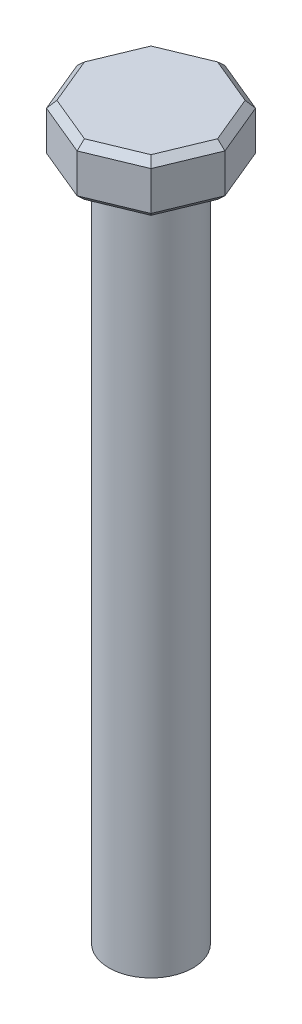
ISO-10303-21;
HEADER;
FILE_DESCRIPTION(('STEP AP214'),'2;1');
FILE_NAME('part.step','',(''),(''),'','','');
FILE_SCHEMA(('AUTOMOTIVE_DESIGN { 1 0 10303 214 1 1 1 1 }'));
ENDSEC;
DATA;
#1=APPLICATION_CONTEXT('core data for automotive mechanical design processes');
#2=APPLICATION_PROTOCOL_DEFINITION('international standard','automotive_design',2000,#1);
#3=PRODUCT_CONTEXT('',#1,'mechanical');
#4=PRODUCT('Part','Part','',(#3));
#5=PRODUCT_RELATED_PRODUCT_CATEGORY('part','',(#4));
#6=PRODUCT_DEFINITION_FORMATION('','',#4);
#7=PRODUCT_DEFINITION_CONTEXT('part definition',#1,'design');
#8=PRODUCT_DEFINITION('design','',#6,#7);
#9=PRODUCT_DEFINITION_SHAPE('','',#8);
#10=(LENGTH_UNIT() NAMED_UNIT(*) SI_UNIT(.MILLI.,.METRE.));
#11=(NAMED_UNIT(*) PLANE_ANGLE_UNIT() SI_UNIT($,.RADIAN.));
#12=(NAMED_UNIT(*) SI_UNIT($,.STERADIAN.) SOLID_ANGLE_UNIT());
#13=UNCERTAINTY_MEASURE_WITH_UNIT(LENGTH_MEASURE(1.E-05),#10,'distance_accuracy_value','');
#14=(GEOMETRIC_REPRESENTATION_CONTEXT(3) GLOBAL_UNCERTAINTY_ASSIGNED_CONTEXT((#13)) GLOBAL_UNIT_ASSIGNED_CONTEXT((#10,
#11,#12)) REPRESENTATION_CONTEXT('',''));
#15=CARTESIAN_POINT('',(0.,0.,0.));
#16=DIRECTION('',(0.,0.,1.));
#17=DIRECTION('',(1.,0.,0.));
#18=AXIS2_PLACEMENT_3D('',#15,#16,#17);
#19=CARTESIAN_POINT('',(0.,64.5,0.));
#20=DIRECTION('',(0.,-1.,0.));
#21=DIRECTION('',(0.,0.,-1.));
#22=AXIS2_PLACEMENT_3D('',#19,#20,#21);
#23=CYLINDRICAL_SURFACE('',#22,4.);
#24=CARTESIAN_POINT('',(0.,64.5,0.));
#25=DIRECTION('',(0.,1.,0.));
#26=DIRECTION('',(0.,0.,1.));
#27=AXIS2_PLACEMENT_3D('',#24,#25,#26);
#28=CIRCLE('',#27,4.);
#29=CARTESIAN_POINT('',(0.,64.5,4.));
#30=VERTEX_POINT('',#29);
#31=EDGE_CURVE('E172',#30,#30,#28,.T.);
#32=ORIENTED_EDGE('',*,*,#31,.F.);
#33=EDGE_LOOP('',(#32));
#34=FACE_BOUND('',#33,.T.);
#35=CARTESIAN_POINT('',(0.,0.,0.));
#36=DIRECTION('',(0.,1.,0.));
#37=DIRECTION('',(0.,0.,1.));
#38=AXIS2_PLACEMENT_3D('',#35,#36,#37);
#39=CIRCLE('',#38,4.);
#40=CARTESIAN_POINT('',(0.,0.,4.));
#41=VERTEX_POINT('',#40);
#42=EDGE_CURVE('E313',#41,#41,#39,.T.);
#43=ORIENTED_EDGE('',*,*,#42,.T.);
#44=EDGE_LOOP('',(#43));
#45=FACE_BOUND('',#44,.T.);
#46=ADVANCED_FACE('F37',(#34,#45),#23,.T.);
#47=CARTESIAN_POINT('',(0.,0.,0.));
#48=DIRECTION('',(0.,1.,0.));
#49=DIRECTION('',(0.,0.,1.));
#50=AXIS2_PLACEMENT_3D('',#47,#48,#49);
#51=PLANE('',#50);
#52=ORIENTED_EDGE('',*,*,#42,.F.);
#53=EDGE_LOOP('',(#52));
#54=FACE_BOUND('',#53,.T.);
#55=ADVANCED_FACE('F376',(#54),#51,.F.);
#56=CARTESIAN_POINT('',(4.97488462074616,69.5,4.97488462074617));
#57=DIRECTION('',(-0.923879532511287,0.,-0.38268343236509));
#58=DIRECTION('',(-0.38268343236509,0.,0.923879532511287));
#59=AXIS2_PLACEMENT_3D('',#56,#57,#58);
#60=PLANE('',#59);
#61=DIRECTION('',(0.,-1.,0.));
#62=VECTOR('',#61,1.);
#63=CARTESIAN_POINT('',(7.03554930190056,69.5,0.));
#64=LINE('',#63,#62);
#65=CARTESIAN_POINT('',(7.03554930190056,68.85,0.));
#66=VERTEX_POINT('',#65);
#67=CARTESIAN_POINT('',(7.03554930190056,65.15,0.));
#68=VERTEX_POINT('',#67);
#69=EDGE_CURVE('E310',#66,#68,#64,.T.);
#70=ORIENTED_EDGE('',*,*,#69,.F.);
#71=DIRECTION('',(-0.38268343236509,0.,0.923879532511287));
#72=VECTOR('',#71,1.);
#73=CARTESIAN_POINT('',(4.97488462074616,68.85,4.97488462074617));
#74=LINE('',#73,#72);
#75=CARTESIAN_POINT('',(4.97488462074616,68.85,4.97488462074617));
#76=VERTEX_POINT('',#75);
#77=EDGE_CURVE('E213',#66,#76,#74,.T.);
#78=ORIENTED_EDGE('',*,*,#77,.T.);
#79=DIRECTION('',(0.,-1.,0.));
#80=VECTOR('',#79,1.);
#81=CARTESIAN_POINT('',(4.97488462074616,69.5,4.97488462074617));
#82=LINE('',#81,#80);
#83=CARTESIAN_POINT('',(4.97488462074616,65.15,4.97488462074617));
#84=VERTEX_POINT('',#83);
#85=EDGE_CURVE('E245',#76,#84,#82,.T.);
#86=ORIENTED_EDGE('',*,*,#85,.T.);
#87=DIRECTION('',(0.38268343236509,0.,-0.923879532511287));
#88=VECTOR('',#87,1.);
#89=CARTESIAN_POINT('',(4.97488462074616,65.15,4.97488462074617));
#90=LINE('',#89,#88);
#91=EDGE_CURVE('E211',#84,#68,#90,.T.);
#92=ORIENTED_EDGE('',*,*,#91,.T.);
#93=EDGE_LOOP('',(#70,#78,#86,#92));
#94=FACE_BOUND('',#93,.T.);
#95=ADVANCED_FACE('F350',(#94),#60,.F.);
#96=CARTESIAN_POINT('',(7.03554930190056,69.5,0.));
#97=DIRECTION('',(-0.923879532511287,0.,0.382683432365089));
#98=DIRECTION('',(0.382683432365089,0.,0.923879532511287));
#99=AXIS2_PLACEMENT_3D('',#96,#97,#98);
#100=PLANE('',#99);
#101=DIRECTION('',(0.,-1.,0.));
#102=VECTOR('',#101,1.);
#103=CARTESIAN_POINT('',(4.97488462074617,69.5,-4.97488462074617));
#104=LINE('',#103,#102);
#105=CARTESIAN_POINT('',(4.97488462074617,68.85,-4.97488462074617));
#106=VERTEX_POINT('',#105);
#107=CARTESIAN_POINT('',(4.97488462074617,65.15,-4.97488462074617));
#108=VERTEX_POINT('',#107);
#109=EDGE_CURVE('E302',#106,#108,#104,.T.);
#110=ORIENTED_EDGE('',*,*,#109,.F.);
#111=DIRECTION('',(0.382683432365089,0.,0.923879532511287));
#112=VECTOR('',#111,1.);
#113=CARTESIAN_POINT('',(7.03554930190056,68.85,0.));
#114=LINE('',#113,#112);
#115=EDGE_CURVE('E209',#106,#66,#114,.T.);
#116=ORIENTED_EDGE('',*,*,#115,.T.);
#117=ORIENTED_EDGE('',*,*,#69,.T.);
#118=DIRECTION('',(-0.382683432365089,0.,-0.923879532511287));
#119=VECTOR('',#118,1.);
#120=CARTESIAN_POINT('',(7.03554930190056,65.15,0.));
#121=LINE('',#120,#119);
#122=EDGE_CURVE('E207',#68,#108,#121,.T.);
#123=ORIENTED_EDGE('',*,*,#122,.T.);
#124=EDGE_LOOP('',(#110,#116,#117,#123));
#125=FACE_BOUND('',#124,.T.);
#126=ADVANCED_FACE('F568',(#125),#100,.F.);
#127=CARTESIAN_POINT('',(4.97488462074617,69.5,-4.97488462074617));
#128=DIRECTION('',(-0.382683432365084,0.,0.923879532511289));
#129=DIRECTION('',(0.923879532511289,0.,0.382683432365084));
#130=AXIS2_PLACEMENT_3D('',#127,#128,#129);
#131=PLANE('',#130);
#132=DIRECTION('',(0.,-1.,0.));
#133=VECTOR('',#132,1.);
#134=CARTESIAN_POINT('',(0.,69.5,-7.03554930190056));
#135=LINE('',#134,#133);
#136=CARTESIAN_POINT('',(0.,68.85,-7.03554930190056));
#137=VERTEX_POINT('',#136);
#138=CARTESIAN_POINT('',(0.,65.15,-7.03554930190056));
#139=VERTEX_POINT('',#138);
#140=EDGE_CURVE('E294',#137,#139,#135,.T.);
#141=ORIENTED_EDGE('',*,*,#140,.F.);
#142=DIRECTION('',(0.923879532511289,0.,0.382683432365084));
#143=VECTOR('',#142,1.);
#144=CARTESIAN_POINT('',(4.97488462074617,68.85,-4.97488462074617));
#145=LINE('',#144,#143);
#146=EDGE_CURVE('E205',#137,#106,#145,.T.);
#147=ORIENTED_EDGE('',*,*,#146,.T.);
#148=ORIENTED_EDGE('',*,*,#109,.T.);
#149=DIRECTION('',(-0.923879532511289,0.,-0.382683432365084));
#150=VECTOR('',#149,1.);
#151=CARTESIAN_POINT('',(4.97488462074617,65.15,-4.97488462074617));
#152=LINE('',#151,#150);
#153=EDGE_CURVE('E203',#108,#139,#152,.T.);
#154=ORIENTED_EDGE('',*,*,#153,.T.);
#155=EDGE_LOOP('',(#141,#147,#148,#154));
#156=FACE_BOUND('',#155,.T.);
#157=ADVANCED_FACE('F560',(#156),#131,.F.);
#158=CARTESIAN_POINT('',(0.,69.5,-7.03554930190056));
#159=DIRECTION('',(0.382683432365095,0.,0.923879532511285));
#160=DIRECTION('',(0.923879532511285,0.,-0.382683432365095));
#161=AXIS2_PLACEMENT_3D('',#158,#159,#160);
#162=PLANE('',#161);
#163=DIRECTION('',(0.,-1.,0.));
#164=VECTOR('',#163,1.);
#165=CARTESIAN_POINT('',(-4.97488462074616,69.5,-4.97488462074617));
#166=LINE('',#165,#164);
#167=CARTESIAN_POINT('',(-4.97488462074616,68.85,-4.97488462074617));
#168=VERTEX_POINT('',#167);
#169=CARTESIAN_POINT('',(-4.97488462074616,65.15,-4.97488462074617));
#170=VERTEX_POINT('',#169);
#171=EDGE_CURVE('E291',#168,#170,#166,.T.);
#172=ORIENTED_EDGE('',*,*,#171,.F.);
#173=DIRECTION('',(0.923879532511285,0.,-0.382683432365095));
#174=VECTOR('',#173,1.);
#175=CARTESIAN_POINT('',(0.,68.85,-7.03554930190056));
#176=LINE('',#175,#174);
#177=EDGE_CURVE('E201',#168,#137,#176,.T.);
#178=ORIENTED_EDGE('',*,*,#177,.T.);
#179=ORIENTED_EDGE('',*,*,#140,.T.);
#180=DIRECTION('',(-0.923879532511285,0.,0.382683432365095));
#181=VECTOR('',#180,1.);
#182=CARTESIAN_POINT('',(0.,65.15,-7.03554930190056));
#183=LINE('',#182,#181);
#184=EDGE_CURVE('E199',#139,#170,#183,.T.);
#185=ORIENTED_EDGE('',*,*,#184,.T.);
#186=EDGE_LOOP('',(#172,#178,#179,#185));
#187=FACE_BOUND('',#186,.T.);
#188=ADVANCED_FACE('F290',(#187),#162,.F.);
#189=CARTESIAN_POINT('',(-4.97488462074616,69.5,-4.97488462074617));
#190=DIRECTION('',(0.923879532511287,0.,0.38268343236509));
#191=DIRECTION('',(0.38268343236509,0.,-0.923879532511287));
#192=AXIS2_PLACEMENT_3D('',#189,#190,#191);
#193=PLANE('',#192);
#194=DIRECTION('',(0.,-1.,0.));
#195=VECTOR('',#194,1.);
#196=CARTESIAN_POINT('',(-7.03554930190056,69.5,0.));
#197=LINE('',#196,#195);
#198=CARTESIAN_POINT('',(-7.03554930190056,68.85,0.));
#199=VERTEX_POINT('',#198);
#200=CARTESIAN_POINT('',(-7.03554930190056,65.15,0.));
#201=VERTEX_POINT('',#200);
#202=EDGE_CURVE('E300',#199,#201,#197,.T.);
#203=ORIENTED_EDGE('',*,*,#202,.F.);
#204=DIRECTION('',(0.38268343236509,0.,-0.923879532511287));
#205=VECTOR('',#204,1.);
#206=CARTESIAN_POINT('',(-4.97488462074616,68.85,-4.97488462074617));
#207=LINE('',#206,#205);
#208=EDGE_CURVE('E197',#199,#168,#207,.T.);
#209=ORIENTED_EDGE('',*,*,#208,.T.);
#210=ORIENTED_EDGE('',*,*,#171,.T.);
#211=DIRECTION('',(-0.38268343236509,0.,0.923879532511287));
#212=VECTOR('',#211,1.);
#213=CARTESIAN_POINT('',(-4.97488462074616,65.15,-4.97488462074617));
#214=LINE('',#213,#212);
#215=EDGE_CURVE('E194',#170,#201,#214,.T.);
#216=ORIENTED_EDGE('',*,*,#215,.T.);
#217=EDGE_LOOP('',(#203,#209,#210,#216));
#218=FACE_BOUND('',#217,.T.);
#219=ADVANCED_FACE('F297',(#218),#193,.F.);
#220=CARTESIAN_POINT('',(-7.03554930190056,69.5,0.));
#221=DIRECTION('',(0.923879532511287,0.,-0.382683432365089));
#222=DIRECTION('',(-0.382683432365089,0.,-0.923879532511287));
#223=AXIS2_PLACEMENT_3D('',#220,#221,#222);
#224=PLANE('',#223);
#225=DIRECTION('',(0.,-1.,0.));
#226=VECTOR('',#225,1.);
#227=CARTESIAN_POINT('',(-4.97488462074617,69.5,4.97488462074616));
#228=LINE('',#227,#226);
#229=CARTESIAN_POINT('',(-4.97488462074617,68.85,4.97488462074616));
#230=VERTEX_POINT('',#229);
#231=CARTESIAN_POINT('',(-4.97488462074617,65.15,4.97488462074616));
#232=VERTEX_POINT('',#231);
#233=EDGE_CURVE('E304',#230,#232,#228,.T.);
#234=ORIENTED_EDGE('',*,*,#233,.F.);
#235=DIRECTION('',(-0.382683432365089,0.,-0.923879532511287));
#236=VECTOR('',#235,1.);
#237=CARTESIAN_POINT('',(-7.03554930190056,68.85,0.));
#238=LINE('',#237,#236);
#239=EDGE_CURVE('E192',#230,#199,#238,.T.);
#240=ORIENTED_EDGE('',*,*,#239,.T.);
#241=ORIENTED_EDGE('',*,*,#202,.T.);
#242=DIRECTION('',(0.382683432365089,0.,0.923879532511287));
#243=VECTOR('',#242,1.);
#244=CARTESIAN_POINT('',(-7.03554930190056,65.15,0.));
#245=LINE('',#244,#243);
#246=EDGE_CURVE('E190',#201,#232,#245,.T.);
#247=ORIENTED_EDGE('',*,*,#246,.T.);
#248=EDGE_LOOP('',(#234,#240,#241,#247));
#249=FACE_BOUND('',#248,.T.);
#250=ADVANCED_FACE('F537',(#249),#224,.F.);
#251=CARTESIAN_POINT('',(-4.97488462074617,69.5,4.97488462074616));
#252=DIRECTION('',(0.38268343236509,0.,-0.923879532511287));
#253=DIRECTION('',(-0.923879532511287,0.,-0.38268343236509));
#254=AXIS2_PLACEMENT_3D('',#251,#252,#253);
#255=PLANE('',#254);
#256=DIRECTION('',(0.,-1.,0.));
#257=VECTOR('',#256,1.);
#258=CARTESIAN_POINT('',(0.,69.5,7.03554930190056));
#259=LINE('',#258,#257);
#260=CARTESIAN_POINT('',(0.,68.85,7.03554930190056));
#261=VERTEX_POINT('',#260);
#262=CARTESIAN_POINT('',(0.,65.15,7.03554930190056));
#263=VERTEX_POINT('',#262);
#264=EDGE_CURVE('E342',#261,#263,#259,.T.);
#265=ORIENTED_EDGE('',*,*,#264,.F.);
#266=DIRECTION('',(-0.923879532511287,0.,-0.38268343236509));
#267=VECTOR('',#266,1.);
#268=CARTESIAN_POINT('',(-4.97488462074617,68.85,4.97488462074616));
#269=LINE('',#268,#267);
#270=EDGE_CURVE('E188',#261,#230,#269,.T.);
#271=ORIENTED_EDGE('',*,*,#270,.T.);
#272=ORIENTED_EDGE('',*,*,#233,.T.);
#273=DIRECTION('',(0.923879532511287,0.,0.38268343236509));
#274=VECTOR('',#273,1.);
#275=CARTESIAN_POINT('',(-4.97488462074617,65.15,4.97488462074616));
#276=LINE('',#275,#274);
#277=EDGE_CURVE('E186',#232,#263,#276,.T.);
#278=ORIENTED_EDGE('',*,*,#277,.T.);
#279=EDGE_LOOP('',(#265,#271,#272,#278));
#280=FACE_BOUND('',#279,.T.);
#281=ADVANCED_FACE('F344',(#280),#255,.F.);
#282=CARTESIAN_POINT('',(0.,69.5,7.03554930190056));
#283=DIRECTION('',(-0.382683432365089,0.,-0.923879532511287));
#284=DIRECTION('',(-0.923879532511287,0.,0.382683432365089));
#285=AXIS2_PLACEMENT_3D('',#282,#283,#284);
#286=PLANE('',#285);
#287=ORIENTED_EDGE('',*,*,#85,.F.);
#288=DIRECTION('',(-0.923879532511287,0.,0.382683432365089));
#289=VECTOR('',#288,1.);
#290=CARTESIAN_POINT('',(0.,68.85,7.03554930190056));
#291=LINE('',#290,#289);
#292=EDGE_CURVE('E159',#76,#261,#291,.T.);
#293=ORIENTED_EDGE('',*,*,#292,.T.);
#294=ORIENTED_EDGE('',*,*,#264,.T.);
#295=DIRECTION('',(0.923879532511287,0.,-0.382683432365089));
#296=VECTOR('',#295,1.);
#297=CARTESIAN_POINT('',(0.,65.15,7.03554930190056));
#298=LINE('',#297,#296);
#299=EDGE_CURVE('E178',#263,#84,#298,.T.);
#300=ORIENTED_EDGE('',*,*,#299,.T.);
#301=EDGE_LOOP('',(#287,#293,#294,#300));
#302=FACE_BOUND('',#301,.T.);
#303=ADVANCED_FACE('F341',(#302),#286,.F.);
#304=CARTESIAN_POINT('',(0.,69.5,0.));
#305=DIRECTION('',(0.,1.,0.));
#306=DIRECTION('',(0.,0.,1.));
#307=AXIS2_PLACEMENT_3D('',#304,#305,#306);
#308=PLANE('',#307);
#309=DIRECTION('',(0.923879532511287,0.,0.38268343236509));
#310=VECTOR('',#309,1.);
#311=CARTESIAN_POINT('',(0.248744231037304,69.5,6.43502760576823));
#312=LINE('',#311,#310);
#313=CARTESIAN_POINT('',(-4.47739615867156,69.5,4.47739615867155));
#314=VERTEX_POINT('',#313);
#315=CARTESIAN_POINT('',(0.,69.5,6.33199437171051));
#316=VERTEX_POINT('',#315);
#317=EDGE_CURVE('E176',#314,#316,#312,.T.);
#318=ORIENTED_EDGE('',*,*,#317,.T.);
#319=DIRECTION('',(0.923879532511287,0.,-0.382683432365089));
#320=VECTOR('',#319,1.);
#321=CARTESIAN_POINT('',(4.72614038970886,69.5,4.37436292461384));
#322=LINE('',#321,#320);
#323=CARTESIAN_POINT('',(4.47739615867155,69.5,4.47739615867156));
#324=VERTEX_POINT('',#323);
#325=EDGE_CURVE('E157',#316,#324,#322,.T.);
#326=ORIENTED_EDGE('',*,*,#325,.T.);
#327=DIRECTION('',(0.38268343236509,0.,-0.923879532511287));
#328=VECTOR('',#327,1.);
#329=CARTESIAN_POINT('',(6.43502760576823,69.5,-0.248744231037306));
#330=LINE('',#329,#328);
#331=CARTESIAN_POINT('',(6.33199437171051,69.5,0.));
#332=VERTEX_POINT('',#331);
#333=EDGE_CURVE('E165',#324,#332,#330,.T.);
#334=ORIENTED_EDGE('',*,*,#333,.T.);
#335=DIRECTION('',(-0.382683432365089,0.,-0.923879532511287));
#336=VECTOR('',#335,1.);
#337=CARTESIAN_POINT('',(4.37436292461384,69.5,-4.72614038970886));
#338=LINE('',#337,#336);
#339=CARTESIAN_POINT('',(4.47739615867156,69.5,-4.47739615867155));
#340=VERTEX_POINT('',#339);
#341=EDGE_CURVE('E171',#332,#340,#338,.T.);
#342=ORIENTED_EDGE('',*,*,#341,.T.);
#343=DIRECTION('',(-0.923879532511289,0.,-0.382683432365084));
#344=VECTOR('',#343,1.);
#345=CARTESIAN_POINT('',(-0.248744231037386,69.5,-6.43502760576823));
#346=LINE('',#345,#344);
#347=CARTESIAN_POINT('',(0.,69.5,-6.33199437171051));
#348=VERTEX_POINT('',#347);
#349=EDGE_CURVE('E319',#340,#348,#346,.T.);
#350=ORIENTED_EDGE('',*,*,#349,.T.);
#351=DIRECTION('',(-0.923879532511285,0.,0.382683432365095));
#352=VECTOR('',#351,1.);
#353=CARTESIAN_POINT('',(-4.72614038970885,69.5,-4.37436292461384));
#354=LINE('',#353,#352);
#355=CARTESIAN_POINT('',(-4.47739615867155,69.5,-4.47739615867156));
#356=VERTEX_POINT('',#355);
#357=EDGE_CURVE('E321',#348,#356,#354,.T.);
#358=ORIENTED_EDGE('',*,*,#357,.T.);
#359=DIRECTION('',(-0.38268343236509,0.,0.923879532511287));
#360=VECTOR('',#359,1.);
#361=CARTESIAN_POINT('',(-6.43502760576823,69.5,0.248744231037305));
#362=LINE('',#361,#360);
#363=CARTESIAN_POINT('',(-6.33199437171051,69.5,0.));
#364=VERTEX_POINT('',#363);
#365=EDGE_CURVE('E323',#356,#364,#362,.T.);
#366=ORIENTED_EDGE('',*,*,#365,.T.);
#367=DIRECTION('',(0.38268343236509,0.,0.923879532511287));
#368=VECTOR('',#367,1.);
#369=CARTESIAN_POINT('',(-4.37436292461384,69.5,4.72614038970886));
#370=LINE('',#369,#368);
#371=EDGE_CURVE('E181',#364,#314,#370,.T.);
#372=ORIENTED_EDGE('',*,*,#371,.T.);
#373=EDGE_LOOP('',(#318,#326,#334,#342,#350,#358,#366,#372));
#374=FACE_BOUND('',#373,.T.);
#375=ADVANCED_FACE('F174',(#374),#308,.T.);
#376=CARTESIAN_POINT('',(0.,64.5,0.));
#377=DIRECTION('',(0.,1.,0.));
#378=DIRECTION('',(0.,0.,1.));
#379=AXIS2_PLACEMENT_3D('',#376,#377,#378);
#380=PLANE('',#379);
#381=DIRECTION('',(-0.38268343236509,0.,-0.923879532511287));
#382=VECTOR('',#381,1.);
#383=CARTESIAN_POINT('',(-5.40469526519102,64.5,2.23869807933577));
#384=LINE('',#383,#382);
#385=CARTESIAN_POINT('',(-4.47739615867154,64.5,4.47739615867154));
#386=VERTEX_POINT('',#385);
#387=CARTESIAN_POINT('',(-6.33199437171049,64.5,0.));
#388=VERTEX_POINT('',#387);
#389=EDGE_CURVE('E215',#386,#388,#384,.T.);
#390=ORIENTED_EDGE('',*,*,#389,.T.);
#391=DIRECTION('',(0.38268343236509,0.,-0.923879532511287));
#392=VECTOR('',#391,1.);
#393=CARTESIAN_POINT('',(-5.40469526519102,64.5,-2.23869807933577));
#394=LINE('',#393,#392);
#395=CARTESIAN_POINT('',(-4.47739615867154,64.5,-4.47739615867155));
#396=VERTEX_POINT('',#395);
#397=EDGE_CURVE('E11',#388,#396,#394,.T.);
#398=ORIENTED_EDGE('',*,*,#397,.T.);
#399=DIRECTION('',(0.923879532511285,0.,-0.382683432365095));
#400=VECTOR('',#399,1.);
#401=CARTESIAN_POINT('',(-2.23869807933581,64.5,-5.40469526519102));
#402=LINE('',#401,#400);
#403=CARTESIAN_POINT('',(0.,64.5,-6.33199437171049));
#404=VERTEX_POINT('',#403);
#405=EDGE_CURVE('E46',#396,#404,#402,.T.);
#406=ORIENTED_EDGE('',*,*,#405,.T.);
#407=DIRECTION('',(0.923879532511289,0.,0.382683432365084));
#408=VECTOR('',#407,1.);
#409=CARTESIAN_POINT('',(2.23869807933573,64.5,-5.40469526519102));
#410=LINE('',#409,#408);
#411=CARTESIAN_POINT('',(4.47739615867154,64.5,-4.47739615867154));
#412=VERTEX_POINT('',#411);
#413=EDGE_CURVE('E225',#404,#412,#410,.T.);
#414=ORIENTED_EDGE('',*,*,#413,.T.);
#415=DIRECTION('',(0.382683432365089,0.,0.923879532511287));
#416=VECTOR('',#415,1.);
#417=CARTESIAN_POINT('',(5.40469526519102,64.5,-2.23869807933577));
#418=LINE('',#417,#416);
#419=CARTESIAN_POINT('',(6.33199437171049,64.5,0.));
#420=VERTEX_POINT('',#419);
#421=EDGE_CURVE('E223',#412,#420,#418,.T.);
#422=ORIENTED_EDGE('',*,*,#421,.T.);
#423=DIRECTION('',(-0.38268343236509,0.,0.923879532511287));
#424=VECTOR('',#423,1.);
#425=CARTESIAN_POINT('',(5.40469526519102,64.5,2.23869807933577));
#426=LINE('',#425,#424);
#427=CARTESIAN_POINT('',(4.47739615867154,64.5,4.47739615867154));
#428=VERTEX_POINT('',#427);
#429=EDGE_CURVE('E221',#420,#428,#426,.T.);
#430=ORIENTED_EDGE('',*,*,#429,.T.);
#431=DIRECTION('',(-0.923879532511287,0.,0.382683432365089));
#432=VECTOR('',#431,1.);
#433=CARTESIAN_POINT('',(2.23869807933577,64.5,5.40469526519102));
#434=LINE('',#433,#432);
#435=CARTESIAN_POINT('',(0.,64.5,6.33199437171049));
#436=VERTEX_POINT('',#435);
#437=EDGE_CURVE('E219',#428,#436,#434,.T.);
#438=ORIENTED_EDGE('',*,*,#437,.T.);
#439=DIRECTION('',(-0.923879532511287,0.,-0.38268343236509));
#440=VECTOR('',#439,1.);
#441=CARTESIAN_POINT('',(-2.23869807933577,64.5,5.40469526519102));
#442=LINE('',#441,#440);
#443=EDGE_CURVE('E217',#436,#386,#442,.T.);
#444=ORIENTED_EDGE('',*,*,#443,.T.);
#445=EDGE_LOOP('',(#390,#398,#406,#414,#422,#430,#438,#444));
#446=FACE_BOUND('',#445,.T.);
#447=ORIENTED_EDGE('',*,*,#31,.T.);
#448=EDGE_LOOP('',(#447));
#449=FACE_BOUND('',#448,.T.);
#450=ADVANCED_FACE('F276',(#446,#449),#380,.F.);
#451=CARTESIAN_POINT('',(-2.23869807933581,69.5,-5.40469526519104));
#452=DIRECTION('',(-0.270598050073103,0.707106781186545,-0.653281482438189));
#453=DIRECTION('',(0.923879532511285,0.,-0.382683432365095));
#454=AXIS2_PLACEMENT_3D('',#451,#452,#453);
#455=PLANE('',#454);
#456=DIRECTION('',(0.,0.678598344545849,0.734509555267753));
#457=VECTOR('',#456,1.);
#458=CARTESIAN_POINT('',(0.,69.9622001553218,-5.83171252861632));
#459=LINE('',#458,#457);
#460=EDGE_CURVE('E239',#137,#348,#459,.T.);
#461=ORIENTED_EDGE('',*,*,#460,.F.);
#462=ORIENTED_EDGE('',*,*,#177,.F.);
#463=DIRECTION('',(0.519376687376145,0.67859834454585,0.519376687376142));
#464=VECTOR('',#463,1.);
#465=CARTESIAN_POINT('',(-4.12364347491516,69.9622001553217,-4.12364347491517));
#466=LINE('',#465,#464);
#467=EDGE_CURVE('E242',#356,#168,#466,.F.);
#468=ORIENTED_EDGE('',*,*,#467,.F.);
#469=ORIENTED_EDGE('',*,*,#357,.F.);
#470=EDGE_LOOP('',(#461,#462,#468,#469));
#471=FACE_BOUND('',#470,.T.);
#472=ADVANCED_FACE('F363',(#471),#455,.T.);
#473=CARTESIAN_POINT('',(-5.40469526519103,69.5,-2.23869807933578));
#474=DIRECTION('',(-0.653281482438191,0.707106781186545,-0.270598050073099));
#475=DIRECTION('',(0.38268343236509,0.,-0.923879532511287));
#476=AXIS2_PLACEMENT_3D('',#473,#474,#475);
#477=PLANE('',#476);
#478=ORIENTED_EDGE('',*,*,#467,.T.);
#479=ORIENTED_EDGE('',*,*,#208,.F.);
#480=DIRECTION('',(0.734509555267753,0.67859834454585,0.));
#481=VECTOR('',#480,1.);
#482=CARTESIAN_POINT('',(-5.83171252861633,69.9622001553217,0.));
#483=LINE('',#482,#481);
#484=EDGE_CURVE('E236',#364,#199,#483,.F.);
#485=ORIENTED_EDGE('',*,*,#484,.F.);
#486=ORIENTED_EDGE('',*,*,#365,.F.);
#487=EDGE_LOOP('',(#478,#479,#485,#486));
#488=FACE_BOUND('',#487,.T.);
#489=ADVANCED_FACE('F366',(#488),#477,.T.);
#490=CARTESIAN_POINT('',(2.23869807933574,69.5,-5.40469526519103));
#491=DIRECTION('',(0.270598050073096,0.707106781186545,-0.653281482438192));
#492=DIRECTION('',(0.923879532511289,0.,0.382683432365084));
#493=AXIS2_PLACEMENT_3D('',#490,#491,#492);
#494=PLANE('',#493);
#495=ORIENTED_EDGE('',*,*,#460,.T.);
#496=ORIENTED_EDGE('',*,*,#349,.F.);
#497=DIRECTION('',(-0.519376687376142,0.678598344545849,0.519376687376146));
#498=VECTOR('',#497,1.);
#499=CARTESIAN_POINT('',(4.12364347491516,69.9622001553218,-4.12364347491515));
#500=LINE('',#499,#498);
#501=EDGE_CURVE('E233',#106,#340,#500,.T.);
#502=ORIENTED_EDGE('',*,*,#501,.F.);
#503=ORIENTED_EDGE('',*,*,#146,.F.);
#504=EDGE_LOOP('',(#495,#496,#502,#503));
#505=FACE_BOUND('',#504,.T.);
#506=ADVANCED_FACE('F359',(#505),#494,.T.);
#507=CARTESIAN_POINT('',(-5.40469526519103,69.5,2.23869807933577));
#508=DIRECTION('',(-0.653281482438191,0.707106781186545,0.270598050073099));
#509=DIRECTION('',(-0.382683432365089,0.,-0.923879532511287));
#510=AXIS2_PLACEMENT_3D('',#507,#508,#509);
#511=PLANE('',#510);
#512=ORIENTED_EDGE('',*,*,#484,.T.);
#513=ORIENTED_EDGE('',*,*,#239,.F.);
#514=DIRECTION('',(0.519376687376143,0.67859834454585,-0.519376687376144));
#515=VECTOR('',#514,1.);
#516=CARTESIAN_POINT('',(-4.12364347491516,69.9622001553217,4.12364347491515));
#517=LINE('',#516,#515);
#518=EDGE_CURVE('E230',#314,#230,#517,.F.);
#519=ORIENTED_EDGE('',*,*,#518,.F.);
#520=ORIENTED_EDGE('',*,*,#371,.F.);
#521=EDGE_LOOP('',(#512,#513,#519,#520));
#522=FACE_BOUND('',#521,.T.);
#523=ADVANCED_FACE('F330',(#522),#511,.T.);
#524=CARTESIAN_POINT('',(5.40469526519103,69.5,-2.23869807933577));
#525=DIRECTION('',(0.653281482438191,0.707106781186545,-0.270598050073099));
#526=DIRECTION('',(0.382683432365089,0.,0.923879532511287));
#527=AXIS2_PLACEMENT_3D('',#524,#525,#526);
#528=PLANE('',#527);
#529=ORIENTED_EDGE('',*,*,#501,.T.);
#530=ORIENTED_EDGE('',*,*,#341,.F.);
#531=DIRECTION('',(-0.734509555267753,0.67859834454585,0.));
#532=VECTOR('',#531,1.);
#533=CARTESIAN_POINT('',(5.83171252861633,69.9622001553217,0.));
#534=LINE('',#533,#532);
#535=EDGE_CURVE('E168',#66,#332,#534,.T.);
#536=ORIENTED_EDGE('',*,*,#535,.F.);
#537=ORIENTED_EDGE('',*,*,#115,.F.);
#538=EDGE_LOOP('',(#529,#530,#536,#537));
#539=FACE_BOUND('',#538,.T.);
#540=ADVANCED_FACE('F354',(#539),#528,.T.);
#541=CARTESIAN_POINT('',(-2.23869807933578,69.5,5.40469526519103));
#542=DIRECTION('',(-0.2705980500731,0.707106781186545,0.65328148243819));
#543=DIRECTION('',(-0.923879532511287,0.,-0.38268343236509));
#544=AXIS2_PLACEMENT_3D('',#541,#542,#543);
#545=PLANE('',#544);
#546=ORIENTED_EDGE('',*,*,#518,.T.);
#547=ORIENTED_EDGE('',*,*,#270,.F.);
#548=DIRECTION('',(0.,0.678598344545849,-0.734509555267753));
#549=VECTOR('',#548,1.);
#550=CARTESIAN_POINT('',(0.,69.9622001553217,5.83171252861633));
#551=LINE('',#550,#549);
#552=EDGE_CURVE('E162',#316,#261,#551,.F.);
#553=ORIENTED_EDGE('',*,*,#552,.F.);
#554=ORIENTED_EDGE('',*,*,#317,.F.);
#555=EDGE_LOOP('',(#546,#547,#553,#554));
#556=FACE_BOUND('',#555,.T.);
#557=ADVANCED_FACE('F333',(#556),#545,.T.);
#558=CARTESIAN_POINT('',(5.40469526519103,69.5,2.23869807933578));
#559=DIRECTION('',(0.653281482438191,0.707106781186545,0.2705980500731));
#560=DIRECTION('',(-0.38268343236509,0.,0.923879532511287));
#561=AXIS2_PLACEMENT_3D('',#558,#559,#560);
#562=PLANE('',#561);
#563=ORIENTED_EDGE('',*,*,#535,.T.);
#564=ORIENTED_EDGE('',*,*,#333,.F.);
#565=DIRECTION('',(0.519376687376143,-0.678598344545849,0.519376687376144));
#566=VECTOR('',#565,1.);
#567=CARTESIAN_POINT('',(4.12364347491515,69.9622001553217,4.12364347491515));
#568=LINE('',#567,#566);
#569=EDGE_CURVE('E153',#76,#324,#568,.F.);
#570=ORIENTED_EDGE('',*,*,#569,.F.);
#571=ORIENTED_EDGE('',*,*,#77,.F.);
#572=EDGE_LOOP('',(#563,#564,#570,#571));
#573=FACE_BOUND('',#572,.T.);
#574=ADVANCED_FACE('F166',(#573),#562,.T.);
#575=CARTESIAN_POINT('',(2.23869807933577,69.5,5.40469526519103));
#576=DIRECTION('',(0.270598050073099,0.707106781186545,0.65328148243819));
#577=DIRECTION('',(-0.923879532511287,0.,0.382683432365089));
#578=AXIS2_PLACEMENT_3D('',#575,#576,#577);
#579=PLANE('',#578);
#580=ORIENTED_EDGE('',*,*,#552,.T.);
#581=ORIENTED_EDGE('',*,*,#292,.F.);
#582=ORIENTED_EDGE('',*,*,#569,.T.);
#583=ORIENTED_EDGE('',*,*,#325,.F.);
#584=EDGE_LOOP('',(#580,#581,#582,#583));
#585=FACE_BOUND('',#584,.T.);
#586=ADVANCED_FACE('F155',(#585),#579,.T.);
#587=CARTESIAN_POINT('',(4.97488462074616,65.15,4.97488462074617));
#588=DIRECTION('',(-0.653281482438189,0.707106781186546,-0.270598050073099));
#589=DIRECTION('',(0.38268343236509,0.,-0.923879532511287));
#590=AXIS2_PLACEMENT_3D('',#587,#588,#589);
#591=PLANE('',#590);
#592=DIRECTION('',(0.519376687376145,0.678598344545848,0.519376687376144));
#593=VECTOR('',#592,1.);
#594=CARTESIAN_POINT('',(4.18876754573194,64.1228885437295,4.18876754573194));
#595=LINE('',#594,#593);
#596=EDGE_CURVE('E260',#428,#84,#595,.T.);
#597=ORIENTED_EDGE('',*,*,#596,.F.);
#598=ORIENTED_EDGE('',*,*,#429,.F.);
#599=DIRECTION('',(0.734509555267754,0.678598344545848,0.));
#600=VECTOR('',#599,1.);
#601=CARTESIAN_POINT('',(5.92381187280237,64.1228885437295,0.));
#602=LINE('',#601,#600);
#603=EDGE_CURVE('E41',#68,#420,#602,.F.);
#604=ORIENTED_EDGE('',*,*,#603,.F.);
#605=ORIENTED_EDGE('',*,*,#91,.F.);
#606=EDGE_LOOP('',(#597,#598,#604,#605));
#607=FACE_BOUND('',#606,.T.);
#608=ADVANCED_FACE('F39',(#607),#591,.F.);
#609=CARTESIAN_POINT('',(7.03554930190056,65.15,0.));
#610=DIRECTION('',(-0.653281482438189,0.707106781186547,0.270598050073098));
#611=DIRECTION('',(-0.382683432365089,0.,-0.923879532511287));
#612=AXIS2_PLACEMENT_3D('',#609,#610,#611);
#613=PLANE('',#612);
#614=ORIENTED_EDGE('',*,*,#603,.T.);
#615=ORIENTED_EDGE('',*,*,#421,.F.);
#616=DIRECTION('',(0.519376687376144,0.678598344545848,-0.519376687376146));
#617=VECTOR('',#616,1.);
#618=CARTESIAN_POINT('',(4.18876754573194,64.1228885437295,-4.18876754573193));
#619=LINE('',#618,#617);
#620=EDGE_CURVE('E258',#108,#412,#619,.F.);
#621=ORIENTED_EDGE('',*,*,#620,.F.);
#622=ORIENTED_EDGE('',*,*,#122,.F.);
#623=EDGE_LOOP('',(#614,#615,#621,#622));
#624=FACE_BOUND('',#623,.T.);
#625=ADVANCED_FACE('F271',(#624),#613,.F.);
#626=CARTESIAN_POINT('',(0.,65.15,7.03554930190056));
#627=DIRECTION('',(-0.270598050073099,0.707106781186546,-0.65328148243819));
#628=DIRECTION('',(0.923879532511287,0.,-0.382683432365089));
#629=AXIS2_PLACEMENT_3D('',#626,#627,#628);
#630=PLANE('',#629);
#631=ORIENTED_EDGE('',*,*,#596,.T.);
#632=ORIENTED_EDGE('',*,*,#299,.F.);
#633=DIRECTION('',(0.,0.678598344545849,0.734509555267754));
#634=VECTOR('',#633,1.);
#635=CARTESIAN_POINT('',(0.,64.1228885437295,5.92381187280237));
#636=LINE('',#635,#634);
#637=EDGE_CURVE('E255',#436,#263,#636,.T.);
#638=ORIENTED_EDGE('',*,*,#637,.F.);
#639=ORIENTED_EDGE('',*,*,#437,.F.);
#640=EDGE_LOOP('',(#631,#632,#638,#639));
#641=FACE_BOUND('',#640,.T.);
#642=ADVANCED_FACE('F428',(#641),#630,.F.);
#643=CARTESIAN_POINT('',(4.97488462074617,65.15,-4.97488462074617));
#644=DIRECTION('',(-0.270598050073095,0.707106781186546,0.653281482438191));
#645=DIRECTION('',(-0.923879532511289,0.,-0.382683432365084));
#646=AXIS2_PLACEMENT_3D('',#643,#644,#645);
#647=PLANE('',#646);
#648=ORIENTED_EDGE('',*,*,#620,.T.);
#649=ORIENTED_EDGE('',*,*,#413,.F.);
#650=DIRECTION('',(0.,0.678598344545848,-0.734509555267755));
#651=VECTOR('',#650,1.);
#652=CARTESIAN_POINT('',(0.,64.1228885437295,-5.92381187280236));
#653=LINE('',#652,#651);
#654=EDGE_CURVE('E252',#139,#404,#653,.F.);
#655=ORIENTED_EDGE('',*,*,#654,.F.);
#656=ORIENTED_EDGE('',*,*,#153,.F.);
#657=EDGE_LOOP('',(#648,#649,#655,#656));
#658=FACE_BOUND('',#657,.T.);
#659=ADVANCED_FACE('F281',(#658),#647,.F.);
#660=CARTESIAN_POINT('',(-4.97488462074617,65.15,4.97488462074616));
#661=DIRECTION('',(0.270598050073099,0.707106781186546,-0.65328148243819));
#662=DIRECTION('',(0.923879532511287,0.,0.38268343236509));
#663=AXIS2_PLACEMENT_3D('',#660,#661,#662);
#664=PLANE('',#663);
#665=ORIENTED_EDGE('',*,*,#637,.T.);
#666=ORIENTED_EDGE('',*,*,#277,.F.);
#667=DIRECTION('',(-0.519376687376145,0.678598344545849,0.519376687376144));
#668=VECTOR('',#667,1.);
#669=CARTESIAN_POINT('',(-4.18876754573195,64.1228885437295,4.18876754573194));
#670=LINE('',#669,#668);
#671=EDGE_CURVE('E249',#386,#232,#670,.T.);
#672=ORIENTED_EDGE('',*,*,#671,.F.);
#673=ORIENTED_EDGE('',*,*,#443,.F.);
#674=EDGE_LOOP('',(#665,#666,#672,#673));
#675=FACE_BOUND('',#674,.T.);
#676=ADVANCED_FACE('F440',(#675),#664,.F.);
#677=CARTESIAN_POINT('',(0.,65.15,-7.03554930190056));
#678=DIRECTION('',(0.270598050073102,0.707106781186547,0.653281482438188));
#679=DIRECTION('',(-0.923879532511285,0.,0.382683432365095));
#680=AXIS2_PLACEMENT_3D('',#677,#678,#679);
#681=PLANE('',#680);
#682=ORIENTED_EDGE('',*,*,#654,.T.);
#683=ORIENTED_EDGE('',*,*,#405,.F.);
#684=DIRECTION('',(-0.519376687376145,0.678598344545848,-0.519376687376144));
#685=VECTOR('',#684,1.);
#686=CARTESIAN_POINT('',(-4.18876754573196,64.1228885437295,-4.18876754573197));
#687=LINE('',#686,#685);
#688=EDGE_CURVE('E54',#170,#396,#687,.F.);
#689=ORIENTED_EDGE('',*,*,#688,.F.);
#690=ORIENTED_EDGE('',*,*,#184,.F.);
#691=EDGE_LOOP('',(#682,#683,#689,#690));
#692=FACE_BOUND('',#691,.T.);
#693=ADVANCED_FACE('F285',(#692),#681,.F.);
#694=CARTESIAN_POINT('',(-7.03554930190056,65.15,0.));
#695=DIRECTION('',(0.65328148243819,0.707106781186546,-0.270598050073099));
#696=DIRECTION('',(0.382683432365089,0.,0.923879532511287));
#697=AXIS2_PLACEMENT_3D('',#694,#695,#696);
#698=PLANE('',#697);
#699=ORIENTED_EDGE('',*,*,#671,.T.);
#700=ORIENTED_EDGE('',*,*,#246,.F.);
#701=DIRECTION('',(0.734509555267754,-0.678598344545848,0.));
#702=VECTOR('',#701,1.);
#703=CARTESIAN_POINT('',(-7.03554930190056,65.15,0.));
#704=LINE('',#703,#702);
#705=EDGE_CURVE('E246',#388,#201,#704,.F.);
#706=ORIENTED_EDGE('',*,*,#705,.F.);
#707=ORIENTED_EDGE('',*,*,#389,.F.);
#708=EDGE_LOOP('',(#699,#700,#706,#707));
#709=FACE_BOUND('',#708,.T.);
#710=ADVANCED_FACE('F454',(#709),#698,.F.);
#711=CARTESIAN_POINT('',(-4.97488462074616,65.15,-4.97488462074617));
#712=DIRECTION('',(0.65328148243819,0.707106781186546,0.270598050073099));
#713=DIRECTION('',(-0.38268343236509,0.,0.923879532511287));
#714=AXIS2_PLACEMENT_3D('',#711,#712,#713);
#715=PLANE('',#714);
#716=ORIENTED_EDGE('',*,*,#688,.T.);
#717=ORIENTED_EDGE('',*,*,#397,.F.);
#718=ORIENTED_EDGE('',*,*,#705,.T.);
#719=ORIENTED_EDGE('',*,*,#215,.F.);
#720=EDGE_LOOP('',(#716,#717,#718,#719));
#721=FACE_BOUND('',#720,.T.);
#722=ADVANCED_FACE('F461',(#721),#715,.F.);
#723=CLOSED_SHELL('',(#46,#55,#95,#126,#157,#188,#219,#250,#281,#303,#375,#450,#472,#489,#506,
#523,#540,#557,#574,#586,#608,#625,#642,#659,#676,#693,#710,#722));
#724=MANIFOLD_SOLID_BREP('B2',#723);
#725=ADVANCED_BREP_SHAPE_REPRESENTATION('',(#18,#724),#14);
#726=SHAPE_DEFINITION_REPRESENTATION(#9,#725);
ENDSEC;
END-ISO-10303-21;
